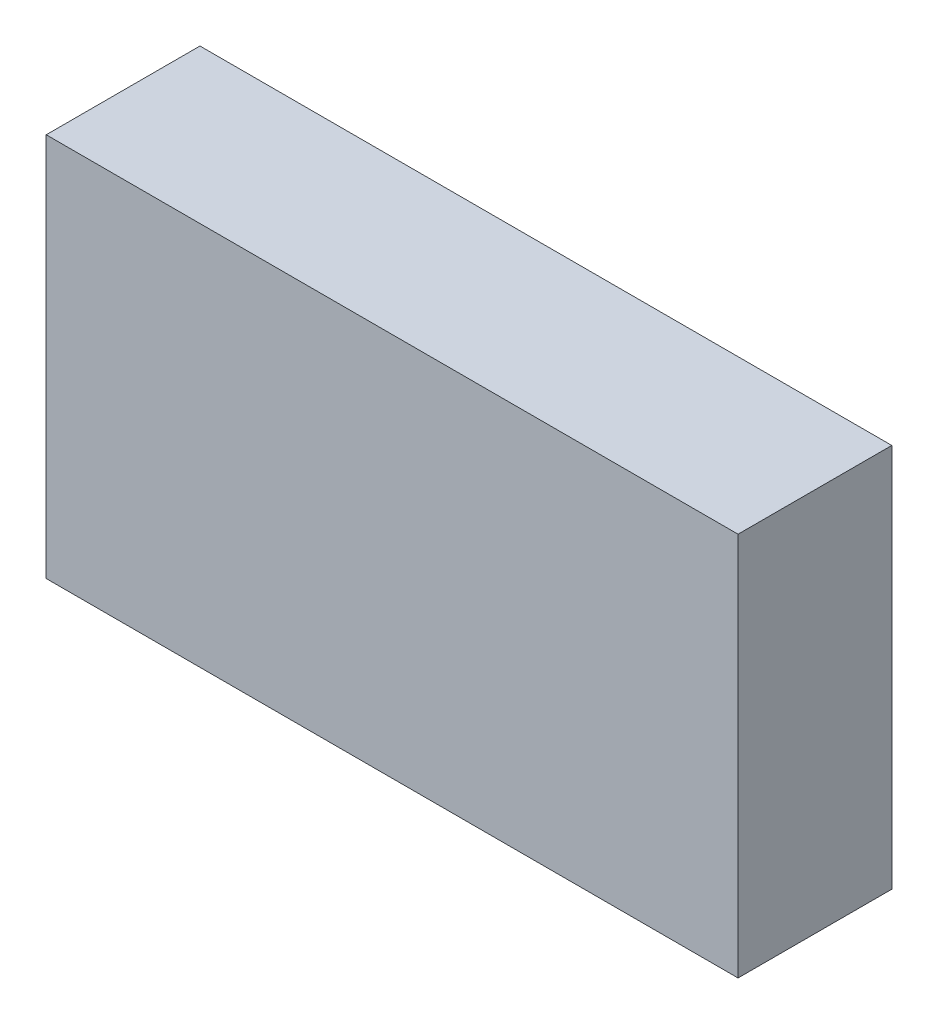
ISO-10303-21;
HEADER;
FILE_DESCRIPTION(('STEP AP214'),'2;1');
FILE_NAME('part.step','',(''),(''),'','','');
FILE_SCHEMA(('AUTOMOTIVE_DESIGN { 1 0 10303 214 1 1 1 1 }'));
ENDSEC;
DATA;
#1=APPLICATION_CONTEXT('core data for automotive mechanical design processes');
#2=APPLICATION_PROTOCOL_DEFINITION('international standard','automotive_design',2000,#1);
#3=PRODUCT_CONTEXT('',#1,'mechanical');
#4=PRODUCT('Part','Part','',(#3));
#5=PRODUCT_RELATED_PRODUCT_CATEGORY('part','',(#4));
#6=PRODUCT_DEFINITION_FORMATION('','',#4);
#7=PRODUCT_DEFINITION_CONTEXT('part definition',#1,'design');
#8=PRODUCT_DEFINITION('design','',#6,#7);
#9=PRODUCT_DEFINITION_SHAPE('','',#8);
#10=(LENGTH_UNIT() NAMED_UNIT(*) SI_UNIT(.MILLI.,.METRE.));
#11=(NAMED_UNIT(*) PLANE_ANGLE_UNIT() SI_UNIT($,.RADIAN.));
#12=(NAMED_UNIT(*) SI_UNIT($,.STERADIAN.) SOLID_ANGLE_UNIT());
#13=UNCERTAINTY_MEASURE_WITH_UNIT(LENGTH_MEASURE(1.E-05),#10,'distance_accuracy_value','');
#14=(GEOMETRIC_REPRESENTATION_CONTEXT(3) GLOBAL_UNCERTAINTY_ASSIGNED_CONTEXT((#13)) GLOBAL_UNIT_ASSIGNED_CONTEXT((#10,
#11,#12)) REPRESENTATION_CONTEXT('',''));
#15=CARTESIAN_POINT('',(0.,0.,0.));
#16=DIRECTION('',(0.,0.,1.));
#17=DIRECTION('',(1.,0.,0.));
#18=AXIS2_PLACEMENT_3D('',#15,#16,#17);
#19=CARTESIAN_POINT('',(1.6,-0.625,0.));
#20=DIRECTION('',(1.,0.,0.));
#21=DIRECTION('',(0.,0.,1.));
#22=AXIS2_PLACEMENT_3D('',#19,#20,#21);
#23=PLANE('',#22);
#24=DIRECTION('',(0.,1.,0.));
#25=VECTOR('',#24,1.);
#26=CARTESIAN_POINT('',(1.6,-0.625,0.1));
#27=LINE('',#26,#25);
#28=CARTESIAN_POINT('',(1.6,-0.625,0.1));
#29=VERTEX_POINT('',#28);
#30=CARTESIAN_POINT('',(1.6,-0.375,0.1));
#31=VERTEX_POINT('',#30);
#32=EDGE_CURVE('E11',#29,#31,#27,.T.);
#33=ORIENTED_EDGE('',*,*,#32,.T.);
#34=DIRECTION('',(0.,0.,1.));
#35=VECTOR('',#34,1.);
#36=CARTESIAN_POINT('',(1.6,-0.375,0.));
#37=LINE('',#36,#35);
#38=CARTESIAN_POINT('',(1.6,-0.375,0.));
#39=VERTEX_POINT('',#38);
#40=EDGE_CURVE('E24',#39,#31,#37,.T.);
#41=ORIENTED_EDGE('',*,*,#40,.F.);
#42=DIRECTION('',(0.,1.,0.));
#43=VECTOR('',#42,1.);
#44=CARTESIAN_POINT('',(1.6,-0.625,0.));
#45=LINE('',#44,#43);
#46=CARTESIAN_POINT('',(1.6,-0.625,0.));
#47=VERTEX_POINT('',#46);
#48=EDGE_CURVE('E86',#47,#39,#45,.T.);
#49=ORIENTED_EDGE('',*,*,#48,.F.);
#50=DIRECTION('',(0.,0.,1.));
#51=VECTOR('',#50,1.);
#52=CARTESIAN_POINT('',(1.6,-0.625,0.));
#53=LINE('',#52,#51);
#54=EDGE_CURVE('E36',#47,#29,#53,.T.);
#55=ORIENTED_EDGE('',*,*,#54,.T.);
#56=EDGE_LOOP('',(#33,#41,#49,#55));
#57=FACE_BOUND('',#56,.T.);
#58=ADVANCED_FACE('F17',(#57),#23,.F.);
#59=CARTESIAN_POINT('',(2.05,-0.625,0.));
#60=DIRECTION('',(1.,0.,0.));
#61=DIRECTION('',(0.,0.,1.));
#62=AXIS2_PLACEMENT_3D('',#59,#60,#61);
#63=PLANE('',#62);
#64=DIRECTION('',(0.,0.,1.));
#65=VECTOR('',#64,1.);
#66=CARTESIAN_POINT('',(2.05,-0.625,0.));
#67=LINE('',#66,#65);
#68=CARTESIAN_POINT('',(2.05,-0.625,0.));
#69=VERTEX_POINT('',#68);
#70=CARTESIAN_POINT('',(2.05,-0.625,0.1));
#71=VERTEX_POINT('',#70);
#72=EDGE_CURVE('E83',#69,#71,#67,.T.);
#73=ORIENTED_EDGE('',*,*,#72,.F.);
#74=DIRECTION('',(0.,1.,0.));
#75=VECTOR('',#74,1.);
#76=CARTESIAN_POINT('',(2.05,-0.625,0.));
#77=LINE('',#76,#75);
#78=CARTESIAN_POINT('',(2.05,-0.375,0.));
#79=VERTEX_POINT('',#78);
#80=EDGE_CURVE('E63',#69,#79,#77,.T.);
#81=ORIENTED_EDGE('',*,*,#80,.T.);
#82=DIRECTION('',(0.,0.,1.));
#83=VECTOR('',#82,1.);
#84=CARTESIAN_POINT('',(2.05,-0.375,0.));
#85=LINE('',#84,#83);
#86=CARTESIAN_POINT('',(2.05,-0.375,0.1));
#87=VERTEX_POINT('',#86);
#88=EDGE_CURVE('E57',#79,#87,#85,.T.);
#89=ORIENTED_EDGE('',*,*,#88,.T.);
#90=DIRECTION('',(0.,1.,0.));
#91=VECTOR('',#90,1.);
#92=CARTESIAN_POINT('',(2.05,-0.625,0.1));
#93=LINE('',#92,#91);
#94=EDGE_CURVE('E60',#71,#87,#93,.T.);
#95=ORIENTED_EDGE('',*,*,#94,.F.);
#96=EDGE_LOOP('',(#73,#81,#89,#95));
#97=FACE_BOUND('',#96,.T.);
#98=ADVANCED_FACE('F59',(#97),#63,.T.);
#99=CARTESIAN_POINT('',(1.6,-0.625,0.));
#100=DIRECTION('',(0.,1.,0.));
#101=DIRECTION('',(0.,0.,1.));
#102=AXIS2_PLACEMENT_3D('',#99,#100,#101);
#103=PLANE('',#102);
#104=ORIENTED_EDGE('',*,*,#72,.T.);
#105=DIRECTION('',(1.,0.,0.));
#106=VECTOR('',#105,1.);
#107=CARTESIAN_POINT('',(1.6,-0.625,0.1));
#108=LINE('',#107,#106);
#109=EDGE_CURVE('E71',#29,#71,#108,.T.);
#110=ORIENTED_EDGE('',*,*,#109,.F.);
#111=ORIENTED_EDGE('',*,*,#54,.F.);
#112=DIRECTION('',(1.,0.,0.));
#113=VECTOR('',#112,1.);
#114=CARTESIAN_POINT('',(1.6,-0.625,0.));
#115=LINE('',#114,#113);
#116=EDGE_CURVE('E76',#47,#69,#115,.T.);
#117=ORIENTED_EDGE('',*,*,#116,.T.);
#118=EDGE_LOOP('',(#104,#110,#111,#117));
#119=FACE_BOUND('',#118,.T.);
#120=ADVANCED_FACE('F91',(#119),#103,.F.);
#121=CARTESIAN_POINT('',(1.6,-0.375,0.));
#122=DIRECTION('',(0.,1.,0.));
#123=DIRECTION('',(0.,0.,1.));
#124=AXIS2_PLACEMENT_3D('',#121,#122,#123);
#125=PLANE('',#124);
#126=DIRECTION('',(1.,0.,0.));
#127=VECTOR('',#126,1.);
#128=CARTESIAN_POINT('',(1.6,-0.375,0.));
#129=LINE('',#128,#127);
#130=EDGE_CURVE('E74',#39,#79,#129,.T.);
#131=ORIENTED_EDGE('',*,*,#130,.F.);
#132=ORIENTED_EDGE('',*,*,#40,.T.);
#133=DIRECTION('',(1.,0.,0.));
#134=VECTOR('',#133,1.);
#135=CARTESIAN_POINT('',(1.6,-0.375,0.1));
#136=LINE('',#135,#134);
#137=EDGE_CURVE('E69',#31,#87,#136,.T.);
#138=ORIENTED_EDGE('',*,*,#137,.T.);
#139=ORIENTED_EDGE('',*,*,#88,.F.);
#140=EDGE_LOOP('',(#131,#132,#138,#139));
#141=FACE_BOUND('',#140,.T.);
#142=ADVANCED_FACE('F73',(#141),#125,.T.);
#143=CARTESIAN_POINT('',(1.6,-0.625,0.));
#144=DIRECTION('',(0.,0.,1.));
#145=DIRECTION('',(1.,0.,0.));
#146=AXIS2_PLACEMENT_3D('',#143,#144,#145);
#147=PLANE('',#146);
#148=ORIENTED_EDGE('',*,*,#130,.T.);
#149=ORIENTED_EDGE('',*,*,#80,.F.);
#150=ORIENTED_EDGE('',*,*,#116,.F.);
#151=ORIENTED_EDGE('',*,*,#48,.T.);
#152=EDGE_LOOP('',(#148,#149,#150,#151));
#153=FACE_BOUND('',#152,.T.);
#154=ADVANCED_FACE('F89',(#153),#147,.F.);
#155=CARTESIAN_POINT('',(1.6,-0.625,0.1));
#156=DIRECTION('',(0.,0.,1.));
#157=DIRECTION('',(1.,0.,0.));
#158=AXIS2_PLACEMENT_3D('',#155,#156,#157);
#159=PLANE('',#158);
#160=ORIENTED_EDGE('',*,*,#32,.F.);
#161=ORIENTED_EDGE('',*,*,#109,.T.);
#162=ORIENTED_EDGE('',*,*,#94,.T.);
#163=ORIENTED_EDGE('',*,*,#137,.F.);
#164=EDGE_LOOP('',(#160,#161,#162,#163));
#165=FACE_BOUND('',#164,.T.);
#166=ADVANCED_FACE('F68',(#165),#159,.T.);
#167=CLOSED_SHELL('',(#58,#98,#120,#142,#154,#166));
#168=MANIFOLD_SOLID_BREP('B1',#167);
#169=ADVANCED_BREP_SHAPE_REPRESENTATION('',(#18,#168),#14);
#170=SHAPE_DEFINITION_REPRESENTATION(#9,#169);
ENDSEC;
END-ISO-10303-21;
